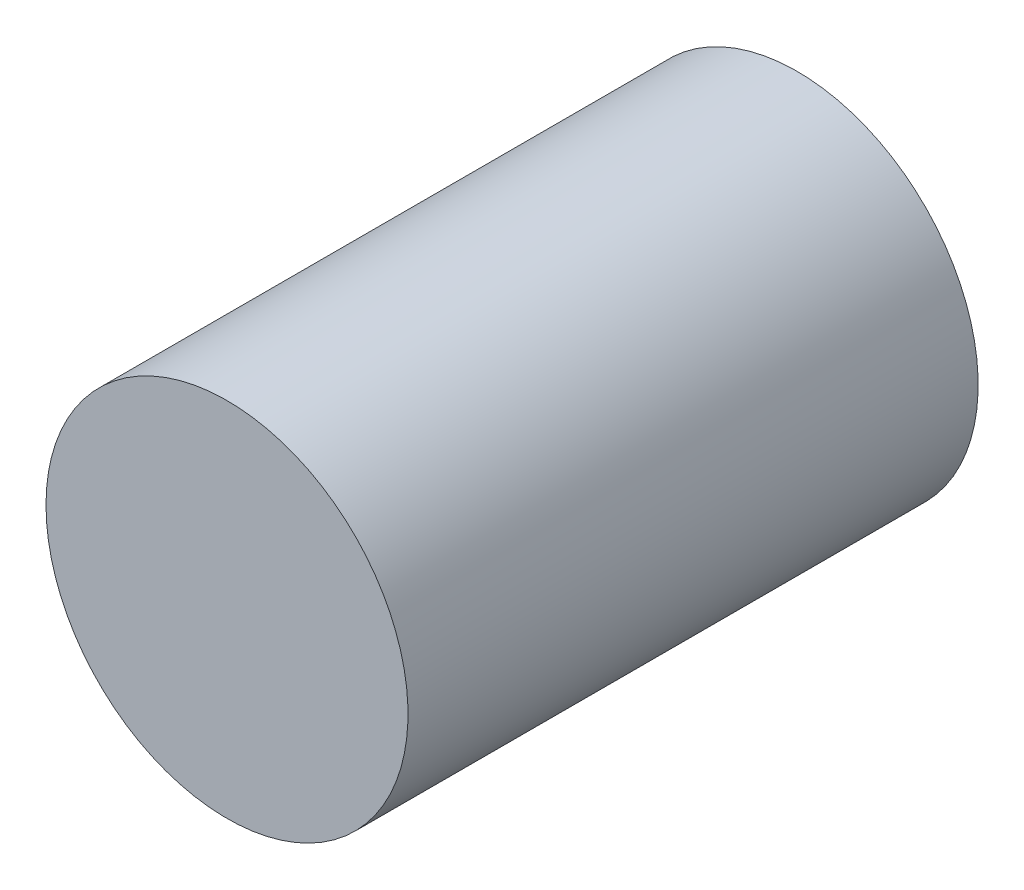
ISO-10303-21;
HEADER;
FILE_DESCRIPTION(('STEP AP214'),'2;1');
FILE_NAME('part.step','',(''),(''),'','','');
FILE_SCHEMA(('AUTOMOTIVE_DESIGN { 1 0 10303 214 1 1 1 1 }'));
ENDSEC;
DATA;
#1=APPLICATION_CONTEXT('core data for automotive mechanical design processes');
#2=APPLICATION_PROTOCOL_DEFINITION('international standard','automotive_design',2000,#1);
#3=PRODUCT_CONTEXT('',#1,'mechanical');
#4=PRODUCT('Part','Part','',(#3));
#5=PRODUCT_RELATED_PRODUCT_CATEGORY('part','',(#4));
#6=PRODUCT_DEFINITION_FORMATION('','',#4);
#7=PRODUCT_DEFINITION_CONTEXT('part definition',#1,'design');
#8=PRODUCT_DEFINITION('design','',#6,#7);
#9=PRODUCT_DEFINITION_SHAPE('','',#8);
#10=(LENGTH_UNIT() NAMED_UNIT(*) SI_UNIT(.MILLI.,.METRE.));
#11=(NAMED_UNIT(*) PLANE_ANGLE_UNIT() SI_UNIT($,.RADIAN.));
#12=(NAMED_UNIT(*) SI_UNIT($,.STERADIAN.) SOLID_ANGLE_UNIT());
#13=UNCERTAINTY_MEASURE_WITH_UNIT(LENGTH_MEASURE(1.E-05),#10,'distance_accuracy_value','');
#14=(GEOMETRIC_REPRESENTATION_CONTEXT(3) GLOBAL_UNCERTAINTY_ASSIGNED_CONTEXT((#13)) GLOBAL_UNIT_ASSIGNED_CONTEXT((#10,
#11,#12)) REPRESENTATION_CONTEXT('',''));
#15=CARTESIAN_POINT('',(0.,0.,0.));
#16=DIRECTION('',(0.,0.,1.));
#17=DIRECTION('',(1.,0.,0.));
#18=AXIS2_PLACEMENT_3D('',#15,#16,#17);
#19=CARTESIAN_POINT('',(8.30010277999987,-9.20010098,7.5500001));
#20=DIRECTION('',(0.,0.,-1.));
#21=DIRECTION('',(-1.,0.,0.));
#22=AXIS2_PLACEMENT_3D('',#19,#20,#21);
#23=PLANE('',#22);
#24=CARTESIAN_POINT('',(8.30010277999987,-7.2000999,7.5500001));
#25=DIRECTION('',(0.,0.,-1.));
#26=DIRECTION('',(-1.,0.,0.));
#27=AXIS2_PLACEMENT_3D('',#24,#25,#26);
#28=CIRCLE('',#27,2.00000108);
#29=CARTESIAN_POINT('',(6.30010169999987,-7.2000999,7.5500001));
#30=VERTEX_POINT('',#29);
#31=EDGE_CURVE('E18',#30,#30,#28,.T.);
#32=ORIENTED_EDGE('',*,*,#31,.F.);
#33=EDGE_LOOP('',(#32));
#34=FACE_BOUND('',#33,.T.);
#35=ADVANCED_FACE('F15',(#34),#23,.F.);
#36=CARTESIAN_POINT('',(8.30010277999987,-9.20010098,1.25));
#37=DIRECTION('',(0.,0.,-1.));
#38=DIRECTION('',(-1.,0.,0.));
#39=AXIS2_PLACEMENT_3D('',#36,#37,#38);
#40=PLANE('',#39);
#41=CARTESIAN_POINT('',(8.30010277999987,-7.2000999,1.25));
#42=DIRECTION('',(0.,0.,-1.));
#43=DIRECTION('',(-1.,0.,0.));
#44=AXIS2_PLACEMENT_3D('',#41,#42,#43);
#45=CIRCLE('',#44,2.00000108);
#46=CARTESIAN_POINT('',(6.30010169999987,-7.2000999,1.25));
#47=VERTEX_POINT('',#46);
#48=EDGE_CURVE('E10',#47,#47,#45,.F.);
#49=ORIENTED_EDGE('',*,*,#48,.F.);
#50=EDGE_LOOP('',(#49));
#51=FACE_BOUND('',#50,.T.);
#52=ADVANCED_FACE('F30',(#51),#40,.T.);
#53=CARTESIAN_POINT('',(8.30010277999987,-7.2000999,1.25));
#54=DIRECTION('',(0.,0.,-1.));
#55=DIRECTION('',(-1.,0.,0.));
#56=AXIS2_PLACEMENT_3D('',#53,#54,#55);
#57=CYLINDRICAL_SURFACE('',#56,2.00000108);
#58=ORIENTED_EDGE('',*,*,#31,.T.);
#59=EDGE_LOOP('',(#58));
#60=FACE_BOUND('',#59,.T.);
#61=ORIENTED_EDGE('',*,*,#48,.T.);
#62=EDGE_LOOP('',(#61));
#63=FACE_BOUND('',#62,.T.);
#64=ADVANCED_FACE('F27',(#60,#63),#57,.T.);
#65=CLOSED_SHELL('',(#35,#52,#64));
#66=MANIFOLD_SOLID_BREP('B1',#65);
#67=ADVANCED_BREP_SHAPE_REPRESENTATION('',(#18,#66),#14);
#68=SHAPE_DEFINITION_REPRESENTATION(#9,#67);
ENDSEC;
END-ISO-10303-21;
